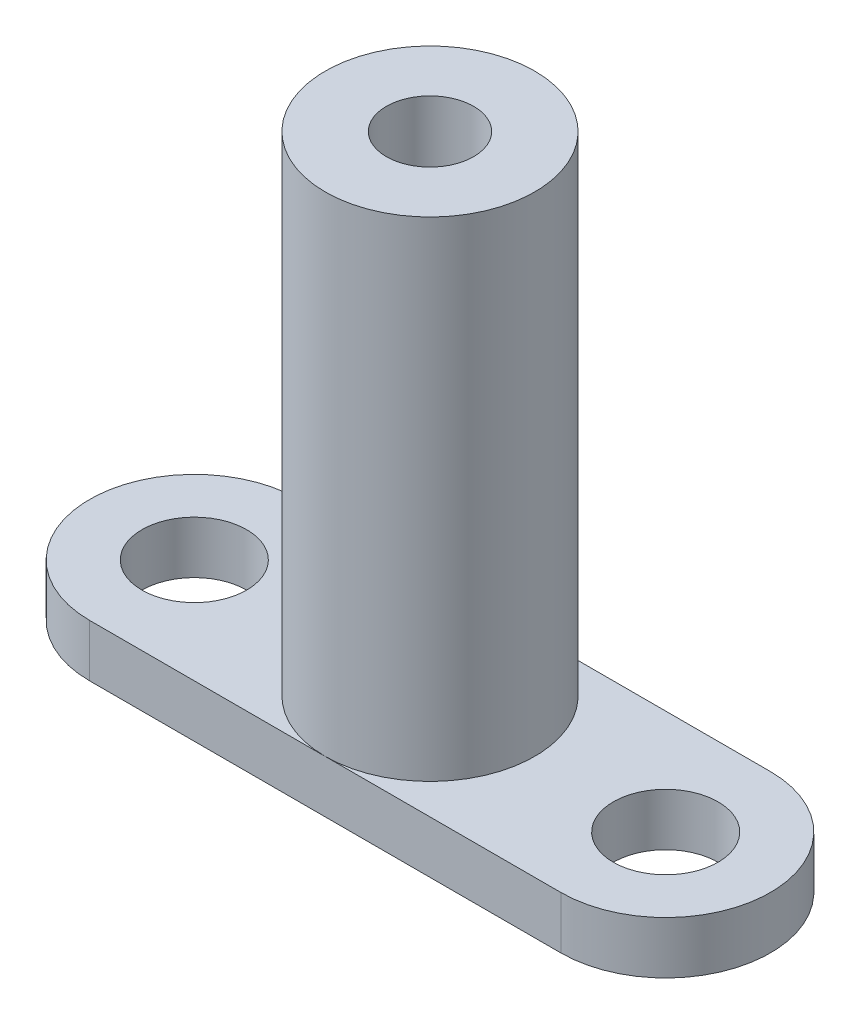
ISO-10303-21;
HEADER;
FILE_DESCRIPTION(('STEP AP214'),'2;1');
FILE_NAME('part.step','',(''),(''),'','','');
FILE_SCHEMA(('AUTOMOTIVE_DESIGN { 1 0 10303 214 1 1 1 1 }'));
ENDSEC;
DATA;
#1=APPLICATION_CONTEXT('core data for automotive mechanical design processes');
#2=APPLICATION_PROTOCOL_DEFINITION('international standard','automotive_design',2000,#1);
#3=PRODUCT_CONTEXT('',#1,'mechanical');
#4=PRODUCT('Part','Part','',(#3));
#5=PRODUCT_RELATED_PRODUCT_CATEGORY('part','',(#4));
#6=PRODUCT_DEFINITION_FORMATION('','',#4);
#7=PRODUCT_DEFINITION_CONTEXT('part definition',#1,'design');
#8=PRODUCT_DEFINITION('design','',#6,#7);
#9=PRODUCT_DEFINITION_SHAPE('','',#8);
#10=(LENGTH_UNIT() NAMED_UNIT(*) SI_UNIT(.MILLI.,.METRE.));
#11=(NAMED_UNIT(*) PLANE_ANGLE_UNIT() SI_UNIT($,.RADIAN.));
#12=(NAMED_UNIT(*) SI_UNIT($,.STERADIAN.) SOLID_ANGLE_UNIT());
#13=UNCERTAINTY_MEASURE_WITH_UNIT(LENGTH_MEASURE(1.E-05),#10,'distance_accuracy_value','');
#14=(GEOMETRIC_REPRESENTATION_CONTEXT(3) GLOBAL_UNCERTAINTY_ASSIGNED_CONTEXT((#13)) GLOBAL_UNIT_ASSIGNED_CONTEXT((#10,
#11,#12)) REPRESENTATION_CONTEXT('',''));
#15=CARTESIAN_POINT('',(0.,0.,0.));
#16=DIRECTION('',(0.,0.,1.));
#17=DIRECTION('',(1.,0.,0.));
#18=AXIS2_PLACEMENT_3D('',#15,#16,#17);
#19=CARTESIAN_POINT('',(0.,3.,0.));
#20=DIRECTION('',(0.,1.,0.));
#21=DIRECTION('',(0.,0.,1.));
#22=AXIS2_PLACEMENT_3D('',#19,#20,#21);
#23=PLANE('',#22);
#24=CARTESIAN_POINT('',(13.5,3.,0.));
#25=DIRECTION('',(0.,1.,0.));
#26=DIRECTION('',(0.,0.,1.));
#27=AXIS2_PLACEMENT_3D('',#24,#25,#26);
#28=CIRCLE('',#27,3.);
#29=CARTESIAN_POINT('',(13.5,3.,3.));
#30=VERTEX_POINT('',#29);
#31=EDGE_CURVE('E153',#30,#30,#28,.T.);
#32=ORIENTED_EDGE('',*,*,#31,.F.);
#33=EDGE_LOOP('',(#32));
#34=FACE_BOUND('',#33,.T.);
#35=CARTESIAN_POINT('',(0.,3.,0.));
#36=DIRECTION('',(0.,1.,0.));
#37=DIRECTION('',(0.,0.,1.));
#38=AXIS2_PLACEMENT_3D('',#35,#36,#37);
#39=CIRCLE('',#38,6.);
#40=CARTESIAN_POINT('',(0.,3.,6.));
#41=VERTEX_POINT('',#40);
#42=CARTESIAN_POINT('',(0.,3.,-6.));
#43=VERTEX_POINT('',#42);
#44=EDGE_CURVE('E52',#41,#43,#39,.T.);
#45=ORIENTED_EDGE('',*,*,#44,.F.);
#46=DIRECTION('',(1.,0.,0.));
#47=VECTOR('',#46,1.);
#48=CARTESIAN_POINT('',(0.,3.,6.));
#49=LINE('',#48,#47);
#50=CARTESIAN_POINT('',(13.5,3.,6.));
#51=VERTEX_POINT('',#50);
#52=EDGE_CURVE('E123',#41,#51,#49,.T.);
#53=ORIENTED_EDGE('',*,*,#52,.T.);
#54=CARTESIAN_POINT('',(13.5,3.,0.));
#55=DIRECTION('',(0.,1.,0.));
#56=DIRECTION('',(0.,0.,1.));
#57=AXIS2_PLACEMENT_3D('',#54,#55,#56);
#58=CIRCLE('',#57,6.);
#59=CARTESIAN_POINT('',(13.5,3.,-6.));
#60=VERTEX_POINT('',#59);
#61=EDGE_CURVE('E126',#51,#60,#58,.T.);
#62=ORIENTED_EDGE('',*,*,#61,.T.);
#63=DIRECTION('',(1.,0.,0.));
#64=VECTOR('',#63,1.);
#65=CARTESIAN_POINT('',(0.,3.,-6.));
#66=LINE('',#65,#64);
#67=EDGE_CURVE('E129',#43,#60,#66,.T.);
#68=ORIENTED_EDGE('',*,*,#67,.F.);
#69=EDGE_LOOP('',(#45,#53,#62,#68));
#70=FACE_BOUND('',#69,.T.);
#71=ADVANCED_FACE('F41',(#34,#70),#23,.T.);
#72=CARTESIAN_POINT('',(-13.5,3.,0.));
#73=DIRECTION('',(0.,-1.,0.));
#74=DIRECTION('',(0.,0.,-1.));
#75=AXIS2_PLACEMENT_3D('',#72,#73,#74);
#76=CYLINDRICAL_SURFACE('',#75,6.);
#77=CARTESIAN_POINT('',(-13.5,0.,0.));
#78=DIRECTION('',(0.,1.,0.));
#79=DIRECTION('',(0.,0.,1.));
#80=AXIS2_PLACEMENT_3D('',#77,#78,#79);
#81=CIRCLE('',#80,6.);
#82=CARTESIAN_POINT('',(-13.5,0.,-6.));
#83=VERTEX_POINT('',#82);
#84=CARTESIAN_POINT('',(-13.5,0.,6.));
#85=VERTEX_POINT('',#84);
#86=EDGE_CURVE('E119',#83,#85,#81,.T.);
#87=ORIENTED_EDGE('',*,*,#86,.T.);
#88=DIRECTION('',(0.,-1.,0.));
#89=VECTOR('',#88,1.);
#90=CARTESIAN_POINT('',(-13.5,3.,6.));
#91=LINE('',#90,#89);
#92=CARTESIAN_POINT('',(-13.5,3.,6.));
#93=VERTEX_POINT('',#92);
#94=EDGE_CURVE('E50',#93,#85,#91,.T.);
#95=ORIENTED_EDGE('',*,*,#94,.F.);
#96=CARTESIAN_POINT('',(-13.5,3.,0.));
#97=DIRECTION('',(0.,1.,0.));
#98=DIRECTION('',(0.,0.,1.));
#99=AXIS2_PLACEMENT_3D('',#96,#97,#98);
#100=CIRCLE('',#99,6.);
#101=CARTESIAN_POINT('',(-13.5,3.,-6.));
#102=VERTEX_POINT('',#101);
#103=EDGE_CURVE('E121',#102,#93,#100,.T.);
#104=ORIENTED_EDGE('',*,*,#103,.F.);
#105=DIRECTION('',(0.,-1.,0.));
#106=VECTOR('',#105,1.);
#107=CARTESIAN_POINT('',(-13.5,3.,-6.));
#108=LINE('',#107,#106);
#109=EDGE_CURVE('E66',#102,#83,#108,.T.);
#110=ORIENTED_EDGE('',*,*,#109,.T.);
#111=EDGE_LOOP('',(#87,#95,#104,#110));
#112=FACE_BOUND('',#111,.T.);
#113=ADVANCED_FACE('F43',(#112),#76,.T.);
#114=CARTESIAN_POINT('',(0.,3.,6.));
#115=DIRECTION('',(0.,0.,-1.));
#116=DIRECTION('',(-1.,0.,0.));
#117=AXIS2_PLACEMENT_3D('',#114,#115,#116);
#118=PLANE('',#117);
#119=DIRECTION('',(1.,0.,0.));
#120=VECTOR('',#119,1.);
#121=CARTESIAN_POINT('',(0.,0.,6.));
#122=LINE('',#121,#120);
#123=CARTESIAN_POINT('',(13.5,0.,6.));
#124=VERTEX_POINT('',#123);
#125=EDGE_CURVE('E133',#85,#124,#122,.T.);
#126=ORIENTED_EDGE('',*,*,#125,.T.);
#127=DIRECTION('',(0.,-1.,0.));
#128=VECTOR('',#127,1.);
#129=CARTESIAN_POINT('',(13.5,3.,6.));
#130=LINE('',#129,#128);
#131=EDGE_CURVE('E143',#51,#124,#130,.T.);
#132=ORIENTED_EDGE('',*,*,#131,.F.);
#133=ORIENTED_EDGE('',*,*,#52,.F.);
#134=EDGE_CURVE('E92',#93,#41,#49,.T.);
#135=ORIENTED_EDGE('',*,*,#134,.F.);
#136=ORIENTED_EDGE('',*,*,#94,.T.);
#137=EDGE_LOOP('',(#126,#132,#133,#135,#136));
#138=FACE_BOUND('',#137,.T.);
#139=ADVANCED_FACE('F192',(#138),#118,.F.);
#140=CARTESIAN_POINT('',(13.5,3.,0.));
#141=DIRECTION('',(0.,-1.,0.));
#142=DIRECTION('',(0.,0.,-1.));
#143=AXIS2_PLACEMENT_3D('',#140,#141,#142);
#144=CYLINDRICAL_SURFACE('',#143,6.);
#145=CARTESIAN_POINT('',(13.5,0.,0.));
#146=DIRECTION('',(0.,1.,0.));
#147=DIRECTION('',(0.,0.,1.));
#148=AXIS2_PLACEMENT_3D('',#145,#146,#147);
#149=CIRCLE('',#148,6.);
#150=CARTESIAN_POINT('',(13.5,0.,-6.));
#151=VERTEX_POINT('',#150);
#152=EDGE_CURVE('E135',#124,#151,#149,.T.);
#153=ORIENTED_EDGE('',*,*,#152,.T.);
#154=DIRECTION('',(0.,-1.,0.));
#155=VECTOR('',#154,1.);
#156=CARTESIAN_POINT('',(13.5,3.,-6.));
#157=LINE('',#156,#155);
#158=EDGE_CURVE('E141',#60,#151,#157,.T.);
#159=ORIENTED_EDGE('',*,*,#158,.F.);
#160=ORIENTED_EDGE('',*,*,#61,.F.);
#161=ORIENTED_EDGE('',*,*,#131,.T.);
#162=EDGE_LOOP('',(#153,#159,#160,#161));
#163=FACE_BOUND('',#162,.T.);
#164=ADVANCED_FACE('F190',(#163),#144,.T.);
#165=CARTESIAN_POINT('',(0.,3.,-6.));
#166=DIRECTION('',(0.,0.,-1.));
#167=DIRECTION('',(-1.,0.,0.));
#168=AXIS2_PLACEMENT_3D('',#165,#166,#167);
#169=PLANE('',#168);
#170=DIRECTION('',(1.,0.,0.));
#171=VECTOR('',#170,1.);
#172=CARTESIAN_POINT('',(0.,0.,-6.));
#173=LINE('',#172,#171);
#174=EDGE_CURVE('E124',#83,#151,#173,.T.);
#175=ORIENTED_EDGE('',*,*,#174,.F.);
#176=ORIENTED_EDGE('',*,*,#109,.F.);
#177=EDGE_CURVE('E130',#102,#43,#66,.T.);
#178=ORIENTED_EDGE('',*,*,#177,.T.);
#179=ORIENTED_EDGE('',*,*,#67,.T.);
#180=ORIENTED_EDGE('',*,*,#158,.T.);
#181=EDGE_LOOP('',(#175,#176,#178,#179,#180));
#182=FACE_BOUND('',#181,.T.);
#183=ADVANCED_FACE('F185',(#182),#169,.T.);
#184=CARTESIAN_POINT('',(-13.5,3.,0.));
#185=DIRECTION('',(0.,1.,0.));
#186=DIRECTION('',(0.,0.,1.));
#187=AXIS2_PLACEMENT_3D('',#184,#185,#186);
#188=CIRCLE('',#187,3.);
#189=CARTESIAN_POINT('',(-13.5,3.,3.));
#190=VERTEX_POINT('',#189);
#191=EDGE_CURVE('E148',#190,#190,#188,.T.);
#192=ORIENTED_EDGE('',*,*,#191,.F.);
#193=EDGE_LOOP('',(#192));
#194=FACE_BOUND('',#193,.T.);
#195=EDGE_CURVE('E11',#43,#41,#39,.T.);
#196=ORIENTED_EDGE('',*,*,#195,.F.);
#197=ORIENTED_EDGE('',*,*,#177,.F.);
#198=ORIENTED_EDGE('',*,*,#103,.T.);
#199=ORIENTED_EDGE('',*,*,#134,.T.);
#200=EDGE_LOOP('',(#196,#197,#198,#199));
#201=FACE_BOUND('',#200,.T.);
#202=ADVANCED_FACE('F166',(#194,#201),#23,.T.);
#203=CARTESIAN_POINT('',(0.,0.,0.));
#204=DIRECTION('',(0.,1.,0.));
#205=DIRECTION('',(0.,0.,1.));
#206=AXIS2_PLACEMENT_3D('',#203,#204,#205);
#207=PLANE('',#206);
#208=CARTESIAN_POINT('',(-13.5,0.,0.));
#209=DIRECTION('',(0.,1.,0.));
#210=DIRECTION('',(0.,0.,1.));
#211=AXIS2_PLACEMENT_3D('',#208,#209,#210);
#212=CIRCLE('',#211,3.);
#213=CARTESIAN_POINT('',(-13.5,0.,3.));
#214=VERTEX_POINT('',#213);
#215=EDGE_CURVE('E45',#214,#214,#212,.T.);
#216=ORIENTED_EDGE('',*,*,#215,.T.);
#217=EDGE_LOOP('',(#216));
#218=FACE_BOUND('',#217,.T.);
#219=CARTESIAN_POINT('',(13.5,0.,0.));
#220=DIRECTION('',(0.,1.,0.));
#221=DIRECTION('',(0.,0.,1.));
#222=AXIS2_PLACEMENT_3D('',#219,#220,#221);
#223=CIRCLE('',#222,3.);
#224=CARTESIAN_POINT('',(13.5,0.,3.));
#225=VERTEX_POINT('',#224);
#226=EDGE_CURVE('E146',#225,#225,#223,.T.);
#227=ORIENTED_EDGE('',*,*,#226,.T.);
#228=EDGE_LOOP('',(#227));
#229=FACE_BOUND('',#228,.T.);
#230=ORIENTED_EDGE('',*,*,#86,.F.);
#231=ORIENTED_EDGE('',*,*,#174,.T.);
#232=ORIENTED_EDGE('',*,*,#152,.F.);
#233=ORIENTED_EDGE('',*,*,#125,.F.);
#234=EDGE_LOOP('',(#230,#231,#232,#233));
#235=FACE_BOUND('',#234,.T.);
#236=ADVANCED_FACE('F172',(#218,#229,#235),#207,.F.);
#237=CARTESIAN_POINT('',(0.,31.,0.));
#238=DIRECTION('',(0.,-1.,0.));
#239=DIRECTION('',(0.,0.,-1.));
#240=AXIS2_PLACEMENT_3D('',#237,#238,#239);
#241=CYLINDRICAL_SURFACE('',#240,6.);
#242=CARTESIAN_POINT('',(0.,31.,0.));
#243=DIRECTION('',(0.,1.,0.));
#244=DIRECTION('',(0.,0.,1.));
#245=AXIS2_PLACEMENT_3D('',#242,#243,#244);
#246=CIRCLE('',#245,6.);
#247=CARTESIAN_POINT('',(0.,31.,6.));
#248=VERTEX_POINT('',#247);
#249=EDGE_CURVE('E113',#248,#248,#246,.T.);
#250=ORIENTED_EDGE('',*,*,#249,.F.);
#251=EDGE_LOOP('',(#250));
#252=FACE_BOUND('',#251,.T.);
#253=ORIENTED_EDGE('',*,*,#44,.T.);
#254=ORIENTED_EDGE('',*,*,#195,.T.);
#255=EDGE_LOOP('',(#253,#254));
#256=FACE_BOUND('',#255,.T.);
#257=ADVANCED_FACE('F170',(#252,#256),#241,.T.);
#258=CARTESIAN_POINT('',(0.,31.,0.));
#259=DIRECTION('',(0.,1.,0.));
#260=DIRECTION('',(0.,0.,1.));
#261=AXIS2_PLACEMENT_3D('',#258,#259,#260);
#262=PLANE('',#261);
#263=CARTESIAN_POINT('',(0.,31.,0.));
#264=DIRECTION('',(0.,1.,0.));
#265=DIRECTION('',(0.,0.,1.));
#266=AXIS2_PLACEMENT_3D('',#263,#264,#265);
#267=CIRCLE('',#266,2.49999999999999);
#268=CARTESIAN_POINT('',(0.,31.,2.49999999999999));
#269=VERTEX_POINT('',#268);
#270=EDGE_CURVE('E110',#269,#269,#267,.T.);
#271=ORIENTED_EDGE('',*,*,#270,.F.);
#272=EDGE_LOOP('',(#271));
#273=FACE_BOUND('',#272,.T.);
#274=ORIENTED_EDGE('',*,*,#249,.T.);
#275=EDGE_LOOP('',(#274));
#276=FACE_BOUND('',#275,.T.);
#277=ADVANCED_FACE('F104',(#273,#276),#262,.T.);
#278=CARTESIAN_POINT('',(0.,19.,0.));
#279=DIRECTION('',(0.,1.,0.));
#280=DIRECTION('',(0.,0.,1.));
#281=AXIS2_PLACEMENT_3D('',#278,#279,#280);
#282=CONICAL_SURFACE('',#281,2.5,1.02974425867665);
#283=CARTESIAN_POINT('',(0.,17.4978484524311,0.));
#284=VERTEX_POINT('',#283);
#285=VERTEX_LOOP('',#284);
#286=FACE_BOUND('',#285,.T.);
#287=CARTESIAN_POINT('',(0.,19.,0.));
#288=DIRECTION('',(0.,1.,0.));
#289=DIRECTION('',(0.,0.,1.));
#290=AXIS2_PLACEMENT_3D('',#287,#288,#289);
#291=CIRCLE('',#290,2.5);
#292=CARTESIAN_POINT('',(0.,19.,2.5));
#293=VERTEX_POINT('',#292);
#294=EDGE_CURVE('E108',#293,#293,#291,.T.);
#295=ORIENTED_EDGE('',*,*,#294,.T.);
#296=EDGE_LOOP('',(#295));
#297=FACE_BOUND('',#296,.T.);
#298=ADVANCED_FACE('F100',(#286,#297),#282,.F.);
#299=CARTESIAN_POINT('',(0.,31.,0.));
#300=DIRECTION('',(0.,1.,0.));
#301=DIRECTION('',(0.,0.,1.));
#302=AXIS2_PLACEMENT_3D('',#299,#300,#301);
#303=CYLINDRICAL_SURFACE('',#302,2.49999999999999);
#304=ORIENTED_EDGE('',*,*,#294,.F.);
#305=EDGE_LOOP('',(#304));
#306=FACE_BOUND('',#305,.T.);
#307=ORIENTED_EDGE('',*,*,#270,.T.);
#308=EDGE_LOOP('',(#307));
#309=FACE_BOUND('',#308,.T.);
#310=ADVANCED_FACE('F103',(#306,#309),#303,.F.);
#311=CARTESIAN_POINT('',(13.5,-7.,0.));
#312=DIRECTION('',(0.,1.,0.));
#313=DIRECTION('',(0.,0.,1.));
#314=AXIS2_PLACEMENT_3D('',#311,#312,#313);
#315=CYLINDRICAL_SURFACE('',#314,3.);
#316=ORIENTED_EDGE('',*,*,#31,.T.);
#317=EDGE_LOOP('',(#316));
#318=FACE_BOUND('',#317,.T.);
#319=ORIENTED_EDGE('',*,*,#226,.F.);
#320=EDGE_LOOP('',(#319));
#321=FACE_BOUND('',#320,.T.);
#322=ADVANCED_FACE('F160',(#318,#321),#315,.F.);
#323=CARTESIAN_POINT('',(-13.5,-7.,0.));
#324=DIRECTION('',(0.,1.,0.));
#325=DIRECTION('',(0.,0.,1.));
#326=AXIS2_PLACEMENT_3D('',#323,#324,#325);
#327=CYLINDRICAL_SURFACE('',#326,3.);
#328=ORIENTED_EDGE('',*,*,#191,.T.);
#329=EDGE_LOOP('',(#328));
#330=FACE_BOUND('',#329,.T.);
#331=ORIENTED_EDGE('',*,*,#215,.F.);
#332=EDGE_LOOP('',(#331));
#333=FACE_BOUND('',#332,.T.);
#334=ADVANCED_FACE('F242',(#330,#333),#327,.F.);
#335=CLOSED_SHELL('',(#71,#113,#139,#164,#183,#202,#236,#257,#277,#298,#310,#322,#334));
#336=MANIFOLD_SOLID_BREP('B2',#335);
#337=ADVANCED_BREP_SHAPE_REPRESENTATION('',(#18,#336),#14);
#338=SHAPE_DEFINITION_REPRESENTATION(#9,#337);
ENDSEC;
END-ISO-10303-21;
